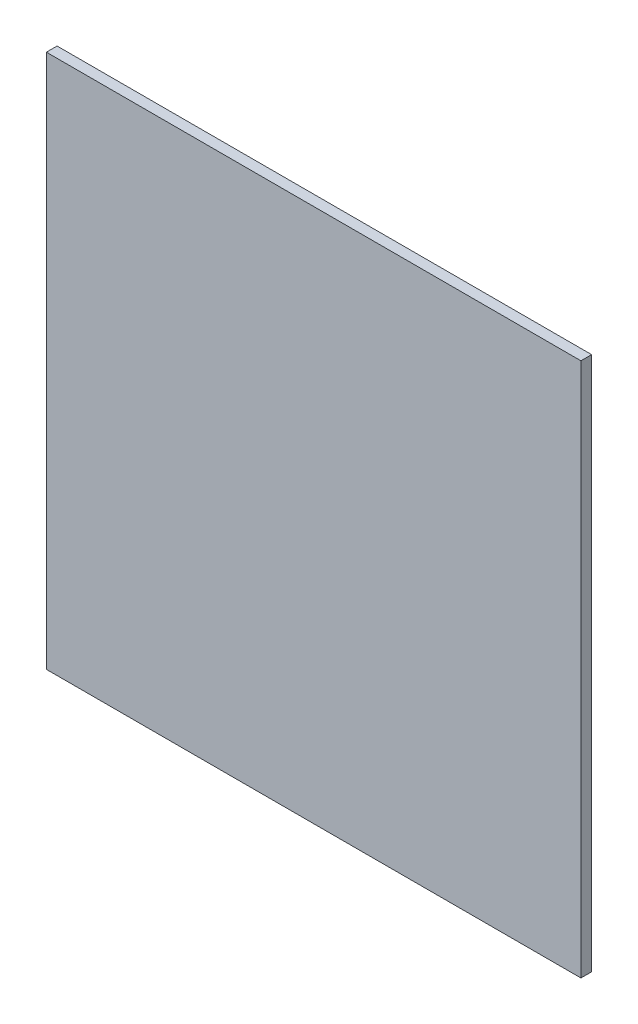
ISO-10303-21;
HEADER;
FILE_DESCRIPTION(('STEP AP214'),'2;1');
FILE_NAME('part.step','',(''),(''),'','','');
FILE_SCHEMA(('AUTOMOTIVE_DESIGN { 1 0 10303 214 1 1 1 1 }'));
ENDSEC;
DATA;
#1=APPLICATION_CONTEXT('core data for automotive mechanical design processes');
#2=APPLICATION_PROTOCOL_DEFINITION('international standard','automotive_design',2000,#1);
#3=PRODUCT_CONTEXT('',#1,'mechanical');
#4=PRODUCT('Part','Part','',(#3));
#5=PRODUCT_RELATED_PRODUCT_CATEGORY('part','',(#4));
#6=PRODUCT_DEFINITION_FORMATION('','',#4);
#7=PRODUCT_DEFINITION_CONTEXT('part definition',#1,'design');
#8=PRODUCT_DEFINITION('design','',#6,#7);
#9=PRODUCT_DEFINITION_SHAPE('','',#8);
#10=(LENGTH_UNIT() NAMED_UNIT(*) SI_UNIT(.MILLI.,.METRE.));
#11=(NAMED_UNIT(*) PLANE_ANGLE_UNIT() SI_UNIT($,.RADIAN.));
#12=(NAMED_UNIT(*) SI_UNIT($,.STERADIAN.) SOLID_ANGLE_UNIT());
#13=UNCERTAINTY_MEASURE_WITH_UNIT(LENGTH_MEASURE(1.E-05),#10,'distance_accuracy_value','');
#14=(GEOMETRIC_REPRESENTATION_CONTEXT(3) GLOBAL_UNCERTAINTY_ASSIGNED_CONTEXT((#13)) GLOBAL_UNIT_ASSIGNED_CONTEXT((#10,
#11,#12)) REPRESENTATION_CONTEXT('',''));
#15=CARTESIAN_POINT('',(0.,0.,0.));
#16=DIRECTION('',(0.,0.,1.));
#17=DIRECTION('',(1.,0.,0.));
#18=AXIS2_PLACEMENT_3D('',#15,#16,#17);
#19=CARTESIAN_POINT('',(0.,-100.,4.));
#20=DIRECTION('',(0.,-1.,0.));
#21=DIRECTION('',(0.,0.,-1.));
#22=AXIS2_PLACEMENT_3D('',#19,#20,#21);
#23=PLANE('',#22);
#24=DIRECTION('',(-1.,0.,0.));
#25=VECTOR('',#24,1.);
#26=CARTESIAN_POINT('',(0.,-100.,0.));
#27=LINE('',#26,#25);
#28=CARTESIAN_POINT('',(100.,-100.,0.));
#29=VERTEX_POINT('',#28);
#30=CARTESIAN_POINT('',(-100.,-100.,0.));
#31=VERTEX_POINT('',#30);
#32=EDGE_CURVE('E108',#29,#31,#27,.T.);
#33=ORIENTED_EDGE('',*,*,#32,.F.);
#34=DIRECTION('',(0.,0.,-1.));
#35=VECTOR('',#34,1.);
#36=CARTESIAN_POINT('',(100.,-100.,4.));
#37=LINE('',#36,#35);
#38=CARTESIAN_POINT('',(100.,-100.,4.));
#39=VERTEX_POINT('',#38);
#40=EDGE_CURVE('E11',#39,#29,#37,.T.);
#41=ORIENTED_EDGE('',*,*,#40,.F.);
#42=DIRECTION('',(-1.,0.,0.));
#43=VECTOR('',#42,1.);
#44=CARTESIAN_POINT('',(0.,-100.,4.));
#45=LINE('',#44,#43);
#46=CARTESIAN_POINT('',(-100.,-100.,4.));
#47=VERTEX_POINT('',#46);
#48=EDGE_CURVE('E99',#39,#47,#45,.T.);
#49=ORIENTED_EDGE('',*,*,#48,.T.);
#50=DIRECTION('',(0.,0.,-1.));
#51=VECTOR('',#50,1.);
#52=CARTESIAN_POINT('',(-100.,-100.,4.));
#53=LINE('',#52,#51);
#54=EDGE_CURVE('E78',#47,#31,#53,.T.);
#55=ORIENTED_EDGE('',*,*,#54,.T.);
#56=EDGE_LOOP('',(#33,#41,#49,#55));
#57=FACE_BOUND('',#56,.T.);
#58=ADVANCED_FACE('F39',(#57),#23,.T.);
#59=CARTESIAN_POINT('',(100.,0.,4.));
#60=DIRECTION('',(1.,0.,0.));
#61=DIRECTION('',(0.,0.,-1.));
#62=AXIS2_PLACEMENT_3D('',#59,#60,#61);
#63=PLANE('',#62);
#64=DIRECTION('',(0.,-1.,0.));
#65=VECTOR('',#64,1.);
#66=CARTESIAN_POINT('',(100.,0.,0.));
#67=LINE('',#66,#65);
#68=CARTESIAN_POINT('',(100.,100.,0.));
#69=VERTEX_POINT('',#68);
#70=EDGE_CURVE('E91',#69,#29,#67,.T.);
#71=ORIENTED_EDGE('',*,*,#70,.F.);
#72=DIRECTION('',(0.,0.,-1.));
#73=VECTOR('',#72,1.);
#74=CARTESIAN_POINT('',(100.,100.,4.));
#75=LINE('',#74,#73);
#76=CARTESIAN_POINT('',(100.,100.,4.));
#77=VERTEX_POINT('',#76);
#78=EDGE_CURVE('E48',#77,#69,#75,.T.);
#79=ORIENTED_EDGE('',*,*,#78,.F.);
#80=DIRECTION('',(0.,-1.,0.));
#81=VECTOR('',#80,1.);
#82=CARTESIAN_POINT('',(100.,0.,4.));
#83=LINE('',#82,#81);
#84=EDGE_CURVE('E89',#77,#39,#83,.T.);
#85=ORIENTED_EDGE('',*,*,#84,.T.);
#86=ORIENTED_EDGE('',*,*,#40,.T.);
#87=EDGE_LOOP('',(#71,#79,#85,#86));
#88=FACE_BOUND('',#87,.T.);
#89=ADVANCED_FACE('F87',(#88),#63,.T.);
#90=CARTESIAN_POINT('',(0.,100.,4.));
#91=DIRECTION('',(0.,-1.,0.));
#92=DIRECTION('',(0.,0.,-1.));
#93=AXIS2_PLACEMENT_3D('',#90,#91,#92);
#94=PLANE('',#93);
#95=DIRECTION('',(-1.,0.,0.));
#96=VECTOR('',#95,1.);
#97=CARTESIAN_POINT('',(0.,100.,0.));
#98=LINE('',#97,#96);
#99=CARTESIAN_POINT('',(-100.,100.,0.));
#100=VERTEX_POINT('',#99);
#101=EDGE_CURVE('E71',#69,#100,#98,.T.);
#102=ORIENTED_EDGE('',*,*,#101,.T.);
#103=DIRECTION('',(0.,0.,-1.));
#104=VECTOR('',#103,1.);
#105=CARTESIAN_POINT('',(-100.,100.,4.));
#106=LINE('',#105,#104);
#107=CARTESIAN_POINT('',(-100.,100.,4.));
#108=VERTEX_POINT('',#107);
#109=EDGE_CURVE('E93',#108,#100,#106,.T.);
#110=ORIENTED_EDGE('',*,*,#109,.F.);
#111=DIRECTION('',(-1.,0.,0.));
#112=VECTOR('',#111,1.);
#113=CARTESIAN_POINT('',(0.,100.,4.));
#114=LINE('',#113,#112);
#115=EDGE_CURVE('E94',#77,#108,#114,.T.);
#116=ORIENTED_EDGE('',*,*,#115,.F.);
#117=ORIENTED_EDGE('',*,*,#78,.T.);
#118=EDGE_LOOP('',(#102,#110,#116,#117));
#119=FACE_BOUND('',#118,.T.);
#120=ADVANCED_FACE('F95',(#119),#94,.F.);
#121=CARTESIAN_POINT('',(-100.,0.,4.));
#122=DIRECTION('',(1.,0.,0.));
#123=DIRECTION('',(0.,0.,-1.));
#124=AXIS2_PLACEMENT_3D('',#121,#122,#123);
#125=PLANE('',#124);
#126=DIRECTION('',(0.,-1.,0.));
#127=VECTOR('',#126,1.);
#128=CARTESIAN_POINT('',(-100.,0.,0.));
#129=LINE('',#128,#127);
#130=EDGE_CURVE('E103',#100,#31,#129,.T.);
#131=ORIENTED_EDGE('',*,*,#130,.T.);
#132=ORIENTED_EDGE('',*,*,#54,.F.);
#133=DIRECTION('',(0.,-1.,0.));
#134=VECTOR('',#133,1.);
#135=CARTESIAN_POINT('',(-100.,0.,4.));
#136=LINE('',#135,#134);
#137=EDGE_CURVE('E56',#108,#47,#136,.T.);
#138=ORIENTED_EDGE('',*,*,#137,.F.);
#139=ORIENTED_EDGE('',*,*,#109,.T.);
#140=EDGE_LOOP('',(#131,#132,#138,#139));
#141=FACE_BOUND('',#140,.T.);
#142=ADVANCED_FACE('F123',(#141),#125,.F.);
#143=CARTESIAN_POINT('',(0.,0.,4.));
#144=DIRECTION('',(0.,0.,1.));
#145=DIRECTION('',(1.,0.,0.));
#146=AXIS2_PLACEMENT_3D('',#143,#144,#145);
#147=PLANE('',#146);
#148=ORIENTED_EDGE('',*,*,#48,.F.);
#149=ORIENTED_EDGE('',*,*,#84,.F.);
#150=ORIENTED_EDGE('',*,*,#115,.T.);
#151=ORIENTED_EDGE('',*,*,#137,.T.);
#152=EDGE_LOOP('',(#148,#149,#150,#151));
#153=FACE_BOUND('',#152,.T.);
#154=ADVANCED_FACE('F98',(#153),#147,.T.);
#155=CARTESIAN_POINT('',(0.,0.,0.));
#156=DIRECTION('',(0.,0.,1.));
#157=DIRECTION('',(1.,0.,0.));
#158=AXIS2_PLACEMENT_3D('',#155,#156,#157);
#159=PLANE('',#158);
#160=ORIENTED_EDGE('',*,*,#32,.T.);
#161=ORIENTED_EDGE('',*,*,#130,.F.);
#162=ORIENTED_EDGE('',*,*,#101,.F.);
#163=ORIENTED_EDGE('',*,*,#70,.T.);
#164=EDGE_LOOP('',(#160,#161,#162,#163));
#165=FACE_BOUND('',#164,.T.);
#166=ADVANCED_FACE('F125',(#165),#159,.F.);
#167=CLOSED_SHELL('',(#58,#89,#120,#142,#154,#166));
#168=MANIFOLD_SOLID_BREP('B2',#167);
#169=ADVANCED_BREP_SHAPE_REPRESENTATION('',(#18,#168),#14);
#170=SHAPE_DEFINITION_REPRESENTATION(#9,#169);
ENDSEC;
END-ISO-10303-21;
